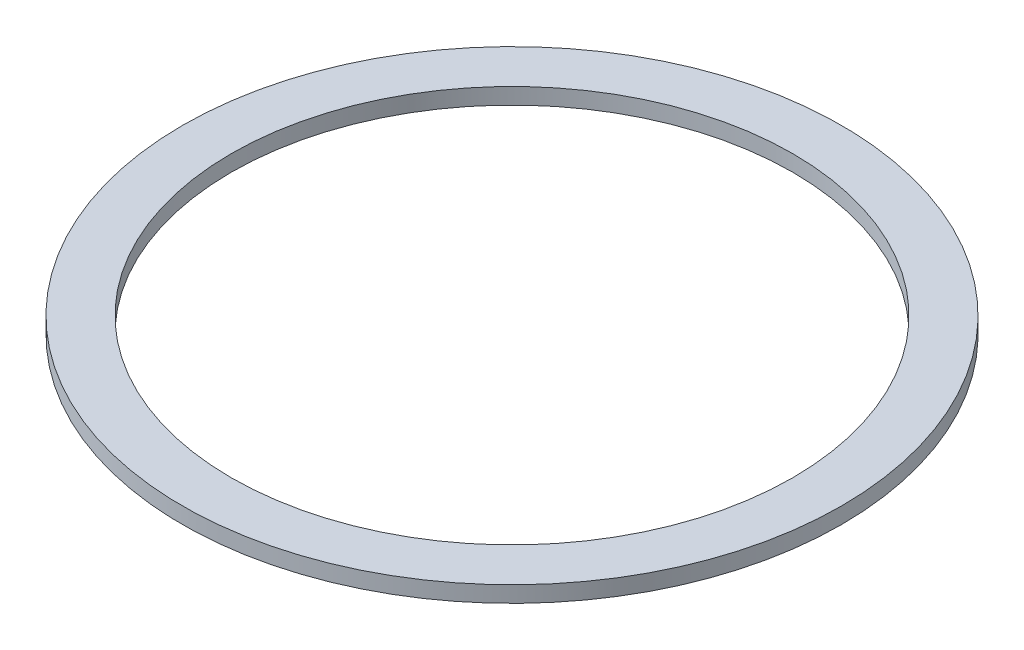
ISO-10303-21;
HEADER;
FILE_DESCRIPTION(('STEP AP214'),'2;1');
FILE_NAME('part.step','',(''),(''),'','','');
FILE_SCHEMA(('AUTOMOTIVE_DESIGN { 1 0 10303 214 1 1 1 1 }'));
ENDSEC;
DATA;
#1=APPLICATION_CONTEXT('core data for automotive mechanical design processes');
#2=APPLICATION_PROTOCOL_DEFINITION('international standard','automotive_design',2000,#1);
#3=PRODUCT_CONTEXT('',#1,'mechanical');
#4=PRODUCT('Part','Part','',(#3));
#5=PRODUCT_RELATED_PRODUCT_CATEGORY('part','',(#4));
#6=PRODUCT_DEFINITION_FORMATION('','',#4);
#7=PRODUCT_DEFINITION_CONTEXT('part definition',#1,'design');
#8=PRODUCT_DEFINITION('design','',#6,#7);
#9=PRODUCT_DEFINITION_SHAPE('','',#8);
#10=(LENGTH_UNIT() NAMED_UNIT(*) SI_UNIT(.MILLI.,.METRE.));
#11=(NAMED_UNIT(*) PLANE_ANGLE_UNIT() SI_UNIT($,.RADIAN.));
#12=(NAMED_UNIT(*) SI_UNIT($,.STERADIAN.) SOLID_ANGLE_UNIT());
#13=UNCERTAINTY_MEASURE_WITH_UNIT(LENGTH_MEASURE(1.E-05),#10,'distance_accuracy_value','');
#14=(GEOMETRIC_REPRESENTATION_CONTEXT(3) GLOBAL_UNCERTAINTY_ASSIGNED_CONTEXT((#13)) GLOBAL_UNIT_ASSIGNED_CONTEXT((#10,
#11,#12)) REPRESENTATION_CONTEXT('',''));
#15=CARTESIAN_POINT('',(0.,0.,0.));
#16=DIRECTION('',(0.,0.,1.));
#17=DIRECTION('',(1.,0.,0.));
#18=AXIS2_PLACEMENT_3D('',#15,#16,#17);
#19=CARTESIAN_POINT('',(0.,0.,0.));
#20=DIRECTION('',(0.,1.,0.));
#21=DIRECTION('',(0.,0.,1.));
#22=AXIS2_PLACEMENT_3D('',#19,#20,#21);
#23=PLANE('',#22);
#24=CARTESIAN_POINT('',(0.,0.,0.));
#25=DIRECTION('',(0.,1.,0.));
#26=DIRECTION('',(0.,0.,1.));
#27=AXIS2_PLACEMENT_3D('',#24,#25,#26);
#28=CIRCLE('',#27,70.375);
#29=CARTESIAN_POINT('',(-70.375,0.,0.));
#30=VERTEX_POINT('',#29);
#31=EDGE_CURVE('E45',#30,#30,#28,.T.);
#32=ORIENTED_EDGE('',*,*,#31,.T.);
#33=EDGE_LOOP('',(#32));
#34=FACE_BOUND('',#33,.T.);
#35=CARTESIAN_POINT('',(0.,0.,0.));
#36=DIRECTION('',(0.,-1.,0.));
#37=DIRECTION('',(0.,0.,-1.));
#38=AXIS2_PLACEMENT_3D('',#35,#36,#37);
#39=CIRCLE('',#38,71.825);
#40=CARTESIAN_POINT('',(0.,0.,-71.825));
#41=VERTEX_POINT('',#40);
#42=EDGE_CURVE('E261',#41,#41,#39,.T.);
#43=ORIENTED_EDGE('',*,*,#42,.T.);
#44=EDGE_LOOP('',(#43));
#45=FACE_BOUND('',#44,.T.);
#46=ADVANCED_FACE('F37',(#34,#45),#23,.F.);
#47=CARTESIAN_POINT('',(0.,1.5,0.));
#48=DIRECTION('',(0.,1.,0.));
#49=DIRECTION('',(0.,0.,1.));
#50=AXIS2_PLACEMENT_3D('',#47,#48,#49);
#51=PLANE('',#50);
#52=CARTESIAN_POINT('',(0.,1.5,0.));
#53=DIRECTION('',(0.,-1.,0.));
#54=DIRECTION('',(0.,0.,-1.));
#55=AXIS2_PLACEMENT_3D('',#52,#53,#54);
#56=CIRCLE('',#55,81.675);
#57=CARTESIAN_POINT('',(-81.675,1.5,0.));
#58=VERTEX_POINT('',#57);
#59=EDGE_CURVE('E142',#58,#58,#56,.T.);
#60=ORIENTED_EDGE('',*,*,#59,.F.);
#61=EDGE_LOOP('',(#60));
#62=FACE_BOUND('',#61,.T.);
#63=CARTESIAN_POINT('',(0.,1.5,0.));
#64=DIRECTION('',(0.,-1.,0.));
#65=DIRECTION('',(0.,0.,-1.));
#66=AXIS2_PLACEMENT_3D('',#63,#64,#65);
#67=CIRCLE('',#66,69.575);
#68=CARTESIAN_POINT('',(-69.575,1.5,0.));
#69=VERTEX_POINT('',#68);
#70=EDGE_CURVE('E93',#69,#69,#67,.T.);
#71=ORIENTED_EDGE('',*,*,#70,.T.);
#72=EDGE_LOOP('',(#71));
#73=FACE_BOUND('',#72,.T.);
#74=ADVANCED_FACE('F91',(#62,#73),#51,.T.);
#75=CARTESIAN_POINT('',(0.,0.,0.));
#76=DIRECTION('',(0.,-1.,0.));
#77=DIRECTION('',(0.,0.,-1.));
#78=AXIS2_PLACEMENT_3D('',#75,#76,#77);
#79=CIRCLE('',#78,79.425);
#80=CARTESIAN_POINT('',(0.,0.,-79.425));
#81=VERTEX_POINT('',#80);
#82=EDGE_CURVE('E99',#81,#81,#79,.T.);
#83=ORIENTED_EDGE('',*,*,#82,.F.);
#84=EDGE_LOOP('',(#83));
#85=FACE_BOUND('',#84,.T.);
#86=CARTESIAN_POINT('',(0.,0.,0.));
#87=DIRECTION('',(0.,1.,0.));
#88=DIRECTION('',(0.,0.,1.));
#89=AXIS2_PLACEMENT_3D('',#86,#87,#88);
#90=CIRCLE('',#89,80.875);
#91=CARTESIAN_POINT('',(-80.875,0.,0.));
#92=VERTEX_POINT('',#91);
#93=EDGE_CURVE('E11',#92,#92,#90,.T.);
#94=ORIENTED_EDGE('',*,*,#93,.F.);
#95=EDGE_LOOP('',(#94));
#96=FACE_BOUND('',#95,.T.);
#97=ADVANCED_FACE('F39',(#85,#96),#23,.F.);
#98=CARTESIAN_POINT('',(0.,1.5,0.));
#99=DIRECTION('',(0.,-1.,0.));
#100=DIRECTION('',(0.,0.,-1.));
#101=AXIS2_PLACEMENT_3D('',#98,#99,#100);
#102=CYLINDRICAL_SURFACE('',#101,80.875);
#103=DIRECTION('',(0.,1.,0.));
#104=VECTOR('',#103,1.);
#105=CARTESIAN_POINT('',(-80.875,1.5,0.));
#106=LINE('',#105,#104);
#107=CARTESIAN_POINT('',(-80.875,-0.35,0.));
#108=VERTEX_POINT('',#107);
#109=EDGE_CURVE('E127',#108,#92,#106,.T.);
#110=ORIENTED_EDGE('',*,*,#109,.T.);
#111=ORIENTED_EDGE('',*,*,#93,.T.);
#112=ORIENTED_EDGE('',*,*,#109,.F.);
#113=CARTESIAN_POINT('',(0.,-0.35,0.));
#114=DIRECTION('',(0.,-1.,0.));
#115=DIRECTION('',(0.,0.,-1.));
#116=AXIS2_PLACEMENT_3D('',#113,#114,#115);
#117=CIRCLE('',#116,80.875);
#118=EDGE_CURVE('E130',#108,#108,#117,.T.);
#119=ORIENTED_EDGE('',*,*,#118,.T.);
#120=EDGE_LOOP('',(#110,#111,#112,#119));
#121=FACE_BOUND('',#120,.T.);
#122=ADVANCED_FACE('F169',(#121),#102,.F.);
#123=CARTESIAN_POINT('',(0.,1.5,0.));
#124=DIRECTION('',(0.,-1.,0.));
#125=DIRECTION('',(0.,0.,-1.));
#126=AXIS2_PLACEMENT_3D('',#123,#124,#125);
#127=CYLINDRICAL_SURFACE('',#126,81.675);
#128=DIRECTION('',(0.,-1.,0.));
#129=VECTOR('',#128,1.);
#130=CARTESIAN_POINT('',(-81.675,-2.5,0.));
#131=LINE('',#130,#129);
#132=CARTESIAN_POINT('',(-81.675,-2.5,0.));
#133=VERTEX_POINT('',#132);
#134=EDGE_CURVE('E115',#58,#133,#131,.T.);
#135=ORIENTED_EDGE('',*,*,#134,.T.);
#136=CARTESIAN_POINT('',(0.,-2.5,0.));
#137=DIRECTION('',(0.,-1.,0.));
#138=DIRECTION('',(0.,0.,-1.));
#139=AXIS2_PLACEMENT_3D('',#136,#137,#138);
#140=CIRCLE('',#139,81.675);
#141=EDGE_CURVE('E139',#133,#133,#140,.T.);
#142=ORIENTED_EDGE('',*,*,#141,.F.);
#143=ORIENTED_EDGE('',*,*,#134,.F.);
#144=ORIENTED_EDGE('',*,*,#59,.T.);
#145=EDGE_LOOP('',(#135,#142,#143,#144));
#146=FACE_BOUND('',#145,.T.);
#147=ADVANCED_FACE('F174',(#146),#127,.T.);
#148=CARTESIAN_POINT('',(-81.675,-2.5,0.));
#149=DIRECTION('',(0.,1.,0.));
#150=DIRECTION('',(0.,0.,1.));
#151=AXIS2_PLACEMENT_3D('',#148,#149,#150);
#152=PLANE('',#151);
#153=ORIENTED_EDGE('',*,*,#141,.T.);
#154=EDGE_LOOP('',(#153));
#155=FACE_BOUND('',#154,.T.);
#156=CARTESIAN_POINT('',(0.,-2.5,0.));
#157=DIRECTION('',(0.,-1.,0.));
#158=DIRECTION('',(0.,0.,-1.));
#159=AXIS2_PLACEMENT_3D('',#156,#157,#158);
#160=CIRCLE('',#159,80.875);
#161=CARTESIAN_POINT('',(-80.875,-2.5,0.));
#162=VERTEX_POINT('',#161);
#163=EDGE_CURVE('E136',#162,#162,#160,.T.);
#164=ORIENTED_EDGE('',*,*,#163,.F.);
#165=EDGE_LOOP('',(#164));
#166=FACE_BOUND('',#165,.T.);
#167=ADVANCED_FACE('F189',(#155,#166),#152,.F.);
#168=CARTESIAN_POINT('',(0.,1.5,0.));
#169=DIRECTION('',(0.,-1.,0.));
#170=DIRECTION('',(0.,0.,-1.));
#171=AXIS2_PLACEMENT_3D('',#168,#169,#170);
#172=CYLINDRICAL_SURFACE('',#171,80.875);
#173=DIRECTION('',(0.,1.,0.));
#174=VECTOR('',#173,1.);
#175=CARTESIAN_POINT('',(-80.875,-1.15,0.));
#176=LINE('',#175,#174);
#177=CARTESIAN_POINT('',(-80.875,-1.15,0.));
#178=VERTEX_POINT('',#177);
#179=EDGE_CURVE('E121',#162,#178,#176,.T.);
#180=ORIENTED_EDGE('',*,*,#179,.T.);
#181=CARTESIAN_POINT('',(0.,-1.15,0.));
#182=DIRECTION('',(0.,-1.,0.));
#183=DIRECTION('',(0.,0.,-1.));
#184=AXIS2_PLACEMENT_3D('',#181,#182,#183);
#185=CIRCLE('',#184,80.875);
#186=EDGE_CURVE('E133',#178,#178,#185,.T.);
#187=ORIENTED_EDGE('',*,*,#186,.F.);
#188=ORIENTED_EDGE('',*,*,#179,.F.);
#189=ORIENTED_EDGE('',*,*,#163,.T.);
#190=EDGE_LOOP('',(#180,#187,#188,#189));
#191=FACE_BOUND('',#190,.T.);
#192=ADVANCED_FACE('F186',(#191),#172,.F.);
#193=CARTESIAN_POINT('',(0.,-0.75,0.));
#194=DIRECTION('',(0.,-1.,0.));
#195=DIRECTION('',(0.,0.,-1.));
#196=AXIS2_PLACEMENT_3D('',#193,#194,#195);
#197=TOROIDAL_SURFACE('',#196,80.875,0.4);
#198=CARTESIAN_POINT('',(-80.875,-0.75,0.));
#199=DIRECTION('',(0.,0.,-1.));
#200=DIRECTION('',(1.,0.,0.));
#201=AXIS2_PLACEMENT_3D('',#198,#199,#200);
#202=CIRCLE('',#201,0.4);
#203=EDGE_CURVE('E124',#178,#108,#202,.T.);
#204=ORIENTED_EDGE('',*,*,#203,.T.);
#205=ORIENTED_EDGE('',*,*,#118,.F.);
#206=ORIENTED_EDGE('',*,*,#203,.F.);
#207=ORIENTED_EDGE('',*,*,#186,.T.);
#208=EDGE_LOOP('',(#204,#205,#206,#207));
#209=FACE_BOUND('',#208,.T.);
#210=ADVANCED_FACE('F183',(#209),#197,.F.);
#211=CARTESIAN_POINT('',(0.,1.5,0.));
#212=DIRECTION('',(0.,-1.,0.));
#213=DIRECTION('',(0.,0.,-1.));
#214=AXIS2_PLACEMENT_3D('',#211,#212,#213);
#215=CYLINDRICAL_SURFACE('',#214,70.375);
#216=DIRECTION('',(0.,-1.,0.));
#217=VECTOR('',#216,1.);
#218=CARTESIAN_POINT('',(-70.375,1.5,0.));
#219=LINE('',#218,#217);
#220=CARTESIAN_POINT('',(-70.375,-2.5,0.));
#221=VERTEX_POINT('',#220);
#222=EDGE_CURVE('E52',#30,#221,#219,.T.);
#223=ORIENTED_EDGE('',*,*,#222,.F.);
#224=ORIENTED_EDGE('',*,*,#31,.F.);
#225=ORIENTED_EDGE('',*,*,#222,.T.);
#226=CARTESIAN_POINT('',(0.,-2.5,0.));
#227=DIRECTION('',(0.,-1.,0.));
#228=DIRECTION('',(0.,0.,-1.));
#229=AXIS2_PLACEMENT_3D('',#226,#227,#228);
#230=CIRCLE('',#229,70.375);
#231=EDGE_CURVE('E111',#221,#221,#230,.T.);
#232=ORIENTED_EDGE('',*,*,#231,.F.);
#233=EDGE_LOOP('',(#223,#224,#225,#232));
#234=FACE_BOUND('',#233,.T.);
#235=ADVANCED_FACE('F146',(#234),#215,.T.);
#236=CARTESIAN_POINT('',(-70.375,-2.5,0.));
#237=DIRECTION('',(0.,1.,0.));
#238=DIRECTION('',(0.,0.,1.));
#239=AXIS2_PLACEMENT_3D('',#236,#237,#238);
#240=PLANE('',#239);
#241=ORIENTED_EDGE('',*,*,#231,.T.);
#242=EDGE_LOOP('',(#241));
#243=FACE_BOUND('',#242,.T.);
#244=CARTESIAN_POINT('',(0.,-2.5,0.));
#245=DIRECTION('',(0.,-1.,0.));
#246=DIRECTION('',(0.,0.,-1.));
#247=AXIS2_PLACEMENT_3D('',#244,#245,#246);
#248=CIRCLE('',#247,69.575);
#249=CARTESIAN_POINT('',(-69.575,-2.5,0.));
#250=VERTEX_POINT('',#249);
#251=EDGE_CURVE('E108',#250,#250,#248,.T.);
#252=ORIENTED_EDGE('',*,*,#251,.F.);
#253=EDGE_LOOP('',(#252));
#254=FACE_BOUND('',#253,.T.);
#255=ADVANCED_FACE('F149',(#243,#254),#240,.F.);
#256=CARTESIAN_POINT('',(0.,1.5,0.));
#257=DIRECTION('',(0.,-1.,0.));
#258=DIRECTION('',(0.,0.,-1.));
#259=AXIS2_PLACEMENT_3D('',#256,#257,#258);
#260=CYLINDRICAL_SURFACE('',#259,69.575);
#261=DIRECTION('',(0.,1.,0.));
#262=VECTOR('',#261,1.);
#263=CARTESIAN_POINT('',(-69.575,-2.5,0.));
#264=LINE('',#263,#262);
#265=EDGE_CURVE('E105',#250,#69,#264,.T.);
#266=ORIENTED_EDGE('',*,*,#265,.T.);
#267=ORIENTED_EDGE('',*,*,#70,.F.);
#268=ORIENTED_EDGE('',*,*,#265,.F.);
#269=ORIENTED_EDGE('',*,*,#251,.T.);
#270=EDGE_LOOP('',(#266,#267,#268,#269));
#271=FACE_BOUND('',#270,.T.);
#272=ADVANCED_FACE('F152',(#271),#260,.F.);
#273=CARTESIAN_POINT('',(0.,0.75,0.));
#274=DIRECTION('',(0.,-1.,0.));
#275=DIRECTION('',(0.,0.,-1.));
#276=AXIS2_PLACEMENT_3D('',#273,#274,#275);
#277=CYLINDRICAL_SURFACE('',#276,79.425);
#278=CARTESIAN_POINT('',(0.,0.75,0.));
#279=DIRECTION('',(0.,-1.,0.));
#280=DIRECTION('',(0.,0.,-1.));
#281=AXIS2_PLACEMENT_3D('',#278,#279,#280);
#282=CIRCLE('',#281,79.425);
#283=CARTESIAN_POINT('',(0.,0.75,-79.425));
#284=VERTEX_POINT('',#283);
#285=EDGE_CURVE('E94',#284,#284,#282,.T.);
#286=ORIENTED_EDGE('',*,*,#285,.F.);
#287=EDGE_LOOP('',(#286));
#288=FACE_BOUND('',#287,.T.);
#289=ORIENTED_EDGE('',*,*,#82,.T.);
#290=EDGE_LOOP('',(#289));
#291=FACE_BOUND('',#290,.T.);
#292=ADVANCED_FACE('F154',(#288,#291),#277,.F.);
#293=CARTESIAN_POINT('',(0.,0.75,0.));
#294=DIRECTION('',(0.,-1.,0.));
#295=DIRECTION('',(0.,0.,-1.));
#296=AXIS2_PLACEMENT_3D('',#293,#294,#295);
#297=PLANE('',#296);
#298=CARTESIAN_POINT('',(0.,0.75,0.));
#299=DIRECTION('',(0.,-1.,0.));
#300=DIRECTION('',(0.,0.,-1.));
#301=AXIS2_PLACEMENT_3D('',#298,#299,#300);
#302=CIRCLE('',#301,71.825);
#303=CARTESIAN_POINT('',(0.,0.75,-71.825));
#304=VERTEX_POINT('',#303);
#305=EDGE_CURVE('E258',#304,#304,#302,.T.);
#306=ORIENTED_EDGE('',*,*,#305,.F.);
#307=EDGE_LOOP('',(#306));
#308=FACE_BOUND('',#307,.T.);
#309=ORIENTED_EDGE('',*,*,#285,.T.);
#310=EDGE_LOOP('',(#309));
#311=FACE_BOUND('',#310,.T.);
#312=ADVANCED_FACE('F160',(#308,#311),#297,.T.);
#313=CARTESIAN_POINT('',(0.,0.75,0.));
#314=DIRECTION('',(0.,-1.,0.));
#315=DIRECTION('',(0.,0.,-1.));
#316=AXIS2_PLACEMENT_3D('',#313,#314,#315);
#317=CYLINDRICAL_SURFACE('',#316,71.825);
#318=ORIENTED_EDGE('',*,*,#305,.T.);
#319=EDGE_LOOP('',(#318));
#320=FACE_BOUND('',#319,.T.);
#321=ORIENTED_EDGE('',*,*,#42,.F.);
#322=EDGE_LOOP('',(#321));
#323=FACE_BOUND('',#322,.T.);
#324=ADVANCED_FACE('F241',(#320,#323),#317,.T.);
#325=CLOSED_SHELL('',(#46,#74,#97,#122,#147,#167,#192,#210,#235,#255,#272,#292,#312,#324));
#326=MANIFOLD_SOLID_BREP('B2',#325);
#327=ADVANCED_BREP_SHAPE_REPRESENTATION('',(#18,#326),#14);
#328=SHAPE_DEFINITION_REPRESENTATION(#9,#327);
ENDSEC;
END-ISO-10303-21;
